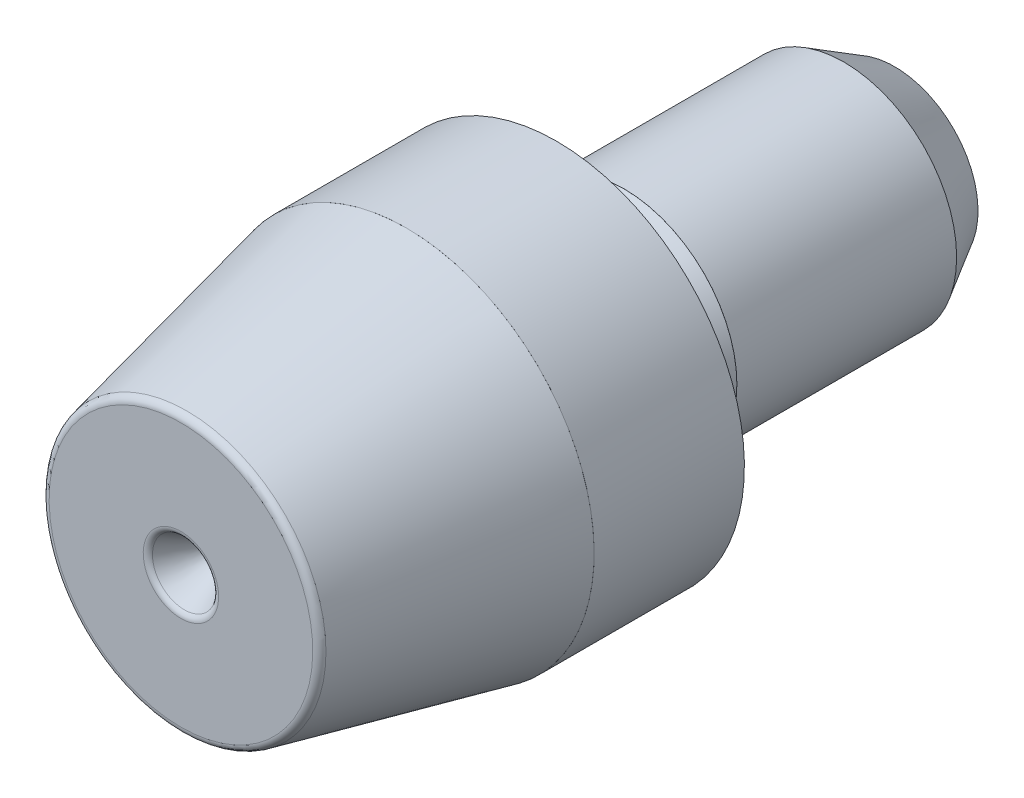
ISO-10303-21;
HEADER;
FILE_DESCRIPTION(('STEP AP214'),'2;1');
FILE_NAME('part.step','',(''),(''),'','','');
FILE_SCHEMA(('AUTOMOTIVE_DESIGN { 1 0 10303 214 1 1 1 1 }'));
ENDSEC;
DATA;
#1=APPLICATION_CONTEXT('core data for automotive mechanical design processes');
#2=APPLICATION_PROTOCOL_DEFINITION('international standard','automotive_design',2000,#1);
#3=PRODUCT_CONTEXT('',#1,'mechanical');
#4=PRODUCT('Part','Part','',(#3));
#5=PRODUCT_RELATED_PRODUCT_CATEGORY('part','',(#4));
#6=PRODUCT_DEFINITION_FORMATION('','',#4);
#7=PRODUCT_DEFINITION_CONTEXT('part definition',#1,'design');
#8=PRODUCT_DEFINITION('design','',#6,#7);
#9=PRODUCT_DEFINITION_SHAPE('','',#8);
#10=(LENGTH_UNIT() NAMED_UNIT(*) SI_UNIT(.MILLI.,.METRE.));
#11=(NAMED_UNIT(*) PLANE_ANGLE_UNIT() SI_UNIT($,.RADIAN.));
#12=(NAMED_UNIT(*) SI_UNIT($,.STERADIAN.) SOLID_ANGLE_UNIT());
#13=UNCERTAINTY_MEASURE_WITH_UNIT(LENGTH_MEASURE(1.E-05),#10,'distance_accuracy_value','');
#14=(GEOMETRIC_REPRESENTATION_CONTEXT(3) GLOBAL_UNCERTAINTY_ASSIGNED_CONTEXT((#13)) GLOBAL_UNIT_ASSIGNED_CONTEXT((#10,
#11,#12)) REPRESENTATION_CONTEXT('',''));
#15=CARTESIAN_POINT('',(0.,0.,0.));
#16=DIRECTION('',(0.,0.,1.));
#17=DIRECTION('',(1.,0.,0.));
#18=AXIS2_PLACEMENT_3D('',#15,#16,#17);
#19=CARTESIAN_POINT('',(0.,0.,-2.3));
#20=DIRECTION('',(0.,0.,-1.));
#21=DIRECTION('',(-1.,0.,0.));
#22=AXIS2_PLACEMENT_3D('',#19,#20,#21);
#23=CYLINDRICAL_SURFACE('',#22,3.001);
#24=CARTESIAN_POINT('',(0.,0.,-2.3));
#25=DIRECTION('',(0.,0.,-1.));
#26=DIRECTION('',(-1.,0.,0.));
#27=AXIS2_PLACEMENT_3D('',#24,#25,#26);
#28=CIRCLE('',#27,3.001);
#29=CARTESIAN_POINT('',(-3.001,0.,-2.3));
#30=VERTEX_POINT('',#29);
#31=EDGE_CURVE('E11',#30,#30,#28,.T.);
#32=ORIENTED_EDGE('',*,*,#31,.T.);
#33=EDGE_LOOP('',(#32));
#34=FACE_BOUND('',#33,.T.);
#35=CARTESIAN_POINT('',(0.,0.,-8.15));
#36=DIRECTION('',(0.,0.,-1.));
#37=DIRECTION('',(-1.,0.,0.));
#38=AXIS2_PLACEMENT_3D('',#35,#36,#37);
#39=CIRCLE('',#38,3.001);
#40=CARTESIAN_POINT('',(-3.001,0.,-8.15));
#41=VERTEX_POINT('',#40);
#42=EDGE_CURVE('E44',#41,#41,#39,.T.);
#43=ORIENTED_EDGE('',*,*,#42,.F.);
#44=EDGE_LOOP('',(#43));
#45=FACE_BOUND('',#44,.T.);
#46=ADVANCED_FACE('F41',(#34,#45),#23,.T.);
#47=CARTESIAN_POINT('',(0.,0.,-2.3));
#48=DIRECTION('',(0.,0.,-1.));
#49=DIRECTION('',(-1.,0.,0.));
#50=AXIS2_PLACEMENT_3D('',#47,#48,#49);
#51=PLANE('',#50);
#52=CARTESIAN_POINT('',(0.,0.,-2.3));
#53=DIRECTION('',(0.,0.,-1.));
#54=DIRECTION('',(-1.,0.,0.));
#55=AXIS2_PLACEMENT_3D('',#52,#53,#54);
#56=CIRCLE('',#55,3.);
#57=CARTESIAN_POINT('',(-3.,0.,-2.3));
#58=VERTEX_POINT('',#57);
#59=EDGE_CURVE('E51',#58,#58,#56,.T.);
#60=ORIENTED_EDGE('',*,*,#59,.T.);
#61=EDGE_LOOP('',(#60));
#62=FACE_BOUND('',#61,.T.);
#63=ORIENTED_EDGE('',*,*,#31,.F.);
#64=EDGE_LOOP('',(#63));
#65=FACE_BOUND('',#64,.T.);
#66=ADVANCED_FACE('F59',(#62,#65),#51,.F.);
#67=CARTESIAN_POINT('',(0.,0.,-8.15));
#68=DIRECTION('',(0.,0.,-1.));
#69=DIRECTION('',(-1.,0.,0.));
#70=AXIS2_PLACEMENT_3D('',#67,#68,#69);
#71=PLANE('',#70);
#72=CARTESIAN_POINT('',(0.,0.,-8.15));
#73=DIRECTION('',(0.,0.,-1.));
#74=DIRECTION('',(-1.,0.,0.));
#75=AXIS2_PLACEMENT_3D('',#72,#73,#74);
#76=CIRCLE('',#75,3.);
#77=CARTESIAN_POINT('',(-3.,0.,-8.15));
#78=VERTEX_POINT('',#77);
#79=EDGE_CURVE('E53',#78,#78,#76,.T.);
#80=ORIENTED_EDGE('',*,*,#79,.F.);
#81=EDGE_LOOP('',(#80));
#82=FACE_BOUND('',#81,.T.);
#83=ORIENTED_EDGE('',*,*,#42,.T.);
#84=EDGE_LOOP('',(#83));
#85=FACE_BOUND('',#84,.T.);
#86=ADVANCED_FACE('F65',(#82,#85),#71,.T.);
#87=CARTESIAN_POINT('',(0.,0.,-2.3));
#88=DIRECTION('',(0.,0.,-1.));
#89=DIRECTION('',(-1.,0.,0.));
#90=AXIS2_PLACEMENT_3D('',#87,#88,#89);
#91=CYLINDRICAL_SURFACE('',#90,3.);
#92=ORIENTED_EDGE('',*,*,#59,.F.);
#93=EDGE_LOOP('',(#92));
#94=FACE_BOUND('',#93,.T.);
#95=ORIENTED_EDGE('',*,*,#79,.T.);
#96=EDGE_LOOP('',(#95));
#97=FACE_BOUND('',#96,.T.);
#98=ADVANCED_FACE('F62',(#94,#97),#91,.F.);
#99=CLOSED_SHELL('',(#46,#66,#86,#98));
#100=MANIFOLD_SOLID_BREP('B2',#99);
#101=CARTESIAN_POINT('',(0.,0.,3.5));
#102=DIRECTION('',(0.,0.,-1.));
#103=DIRECTION('',(0.,1.,0.));
#104=AXIS2_PLACEMENT_3D('',#101,#102,#103);
#105=CYLINDRICAL_SURFACE('',#104,5.001);
#106=CARTESIAN_POINT('',(0.,0.,3.5));
#107=DIRECTION('',(0.,0.,-1.));
#108=DIRECTION('',(0.,1.,0.));
#109=AXIS2_PLACEMENT_3D('',#106,#107,#108);
#110=CIRCLE('',#109,5.001);
#111=CARTESIAN_POINT('',(0.,5.001,3.5));
#112=VERTEX_POINT('',#111);
#113=EDGE_CURVE('E40',#112,#112,#110,.T.);
#114=ORIENTED_EDGE('',*,*,#113,.T.);
#115=EDGE_LOOP('',(#114));
#116=FACE_BOUND('',#115,.T.);
#117=CARTESIAN_POINT('',(0.,0.,-0.500000000000001));
#118=DIRECTION('',(0.,0.,-1.));
#119=DIRECTION('',(0.,1.,0.));
#120=AXIS2_PLACEMENT_3D('',#117,#118,#119);
#121=CIRCLE('',#120,5.001);
#122=CARTESIAN_POINT('',(0.,5.001,-0.5));
#123=VERTEX_POINT('',#122);
#124=EDGE_CURVE('E112',#123,#123,#121,.T.);
#125=ORIENTED_EDGE('',*,*,#124,.F.);
#126=EDGE_LOOP('',(#125));
#127=FACE_BOUND('',#126,.T.);
#128=ADVANCED_FACE('F109',(#116,#127),#105,.T.);
#129=CARTESIAN_POINT('',(0.,0.,3.5));
#130=DIRECTION('',(0.,0.,-1.));
#131=DIRECTION('',(0.,1.,0.));
#132=AXIS2_PLACEMENT_3D('',#129,#130,#131);
#133=PLANE('',#132);
#134=CARTESIAN_POINT('',(0.,0.,3.5));
#135=DIRECTION('',(0.,0.,-1.));
#136=DIRECTION('',(0.,1.,0.));
#137=AXIS2_PLACEMENT_3D('',#134,#135,#136);
#138=CIRCLE('',#137,5.);
#139=CARTESIAN_POINT('',(0.,5.,3.5));
#140=VERTEX_POINT('',#139);
#141=EDGE_CURVE('E119',#140,#140,#138,.T.);
#142=ORIENTED_EDGE('',*,*,#141,.T.);
#143=EDGE_LOOP('',(#142));
#144=FACE_BOUND('',#143,.T.);
#145=ORIENTED_EDGE('',*,*,#113,.F.);
#146=EDGE_LOOP('',(#145));
#147=FACE_BOUND('',#146,.T.);
#148=ADVANCED_FACE('F127',(#144,#147),#133,.F.);
#149=CARTESIAN_POINT('',(0.,0.,-0.500000000000001));
#150=DIRECTION('',(0.,0.,-1.));
#151=DIRECTION('',(0.,1.,0.));
#152=AXIS2_PLACEMENT_3D('',#149,#150,#151);
#153=PLANE('',#152);
#154=CARTESIAN_POINT('',(0.,0.,-0.500000000000001));
#155=DIRECTION('',(0.,0.,-1.));
#156=DIRECTION('',(0.,1.,0.));
#157=AXIS2_PLACEMENT_3D('',#154,#155,#156);
#158=CIRCLE('',#157,5.);
#159=CARTESIAN_POINT('',(0.,5.,-0.5));
#160=VERTEX_POINT('',#159);
#161=EDGE_CURVE('E121',#160,#160,#158,.T.);
#162=ORIENTED_EDGE('',*,*,#161,.F.);
#163=EDGE_LOOP('',(#162));
#164=FACE_BOUND('',#163,.T.);
#165=ORIENTED_EDGE('',*,*,#124,.T.);
#166=EDGE_LOOP('',(#165));
#167=FACE_BOUND('',#166,.T.);
#168=ADVANCED_FACE('F133',(#164,#167),#153,.T.);
#169=CARTESIAN_POINT('',(0.,0.,3.5));
#170=DIRECTION('',(0.,0.,-1.));
#171=DIRECTION('',(0.,1.,0.));
#172=AXIS2_PLACEMENT_3D('',#169,#170,#171);
#173=CYLINDRICAL_SURFACE('',#172,5.);
#174=ORIENTED_EDGE('',*,*,#141,.F.);
#175=EDGE_LOOP('',(#174));
#176=FACE_BOUND('',#175,.T.);
#177=ORIENTED_EDGE('',*,*,#161,.T.);
#178=EDGE_LOOP('',(#177));
#179=FACE_BOUND('',#178,.T.);
#180=ADVANCED_FACE('F130',(#176,#179),#173,.F.);
#181=CLOSED_SHELL('',(#128,#148,#168,#180));
#182=MANIFOLD_SOLID_BREP('B6',#181);
#183=CARTESIAN_POINT('',(0.,0.,9.5));
#184=DIRECTION('',(0.,0.,1.));
#185=DIRECTION('',(0.,-1.,0.));
#186=AXIS2_PLACEMENT_3D('',#183,#184,#185);
#187=PLANE('',#186);
#188=CARTESIAN_POINT('',(0.,0.,9.5));
#189=DIRECTION('',(0.,0.,1.));
#190=DIRECTION('',(0.,-1.,0.));
#191=AXIS2_PLACEMENT_3D('',#188,#189,#190);
#192=CIRCLE('',#191,1.00392304845413);
#193=CARTESIAN_POINT('',(0.,-1.00392304845413,9.5));
#194=VERTEX_POINT('',#193);
#195=EDGE_CURVE('E108',#194,#194,#192,.F.);
#196=ORIENTED_EDGE('',*,*,#195,.T.);
#197=EDGE_LOOP('',(#196));
#198=FACE_BOUND('',#197,.T.);
#199=CARTESIAN_POINT('',(0.,0.,9.5));
#200=DIRECTION('',(0.,0.,1.));
#201=DIRECTION('',(0.,-1.,0.));
#202=AXIS2_PLACEMENT_3D('',#199,#200,#201);
#203=CIRCLE('',#202,3.50931505380808);
#204=CARTESIAN_POINT('',(0.,-3.50931505380808,9.5));
#205=VERTEX_POINT('',#204);
#206=EDGE_CURVE('E190',#205,#205,#203,.T.);
#207=ORIENTED_EDGE('',*,*,#206,.T.);
#208=EDGE_LOOP('',(#207));
#209=FACE_BOUND('',#208,.T.);
#210=ADVANCED_FACE('F170',(#198,#209),#187,.T.);
#211=CARTESIAN_POINT('',(0.,0.,3.5));
#212=DIRECTION('',(0.,0.,-1.));
#213=DIRECTION('',(0.,1.,0.));
#214=AXIS2_PLACEMENT_3D('',#211,#212,#213);
#215=CONICAL_SURFACE('',#214,5.,0.218166156499285);
#216=CARTESIAN_POINT('',(0.,0.,9.34328792278761));
#217=DIRECTION('',(0.,0.,1.));
#218=DIRECTION('',(0.,-1.,0.));
#219=AXIS2_PLACEMENT_3D('',#216,#217,#218);
#220=CIRCLE('',#219,3.70457425523207);
#221=CARTESIAN_POINT('',(0.,-3.70457425523207,9.34328792278761));
#222=VERTEX_POINT('',#221);
#223=EDGE_CURVE('E193',#222,#222,#220,.F.);
#224=ORIENTED_EDGE('',*,*,#223,.T.);
#225=EDGE_LOOP('',(#224));
#226=FACE_BOUND('',#225,.T.);
#227=CARTESIAN_POINT('',(0.,0.,3.5));
#228=DIRECTION('',(0.,0.,-1.));
#229=DIRECTION('',(0.,1.,0.));
#230=AXIS2_PLACEMENT_3D('',#227,#228,#229);
#231=CIRCLE('',#230,5.);
#232=CARTESIAN_POINT('',(0.,5.,3.5));
#233=VERTEX_POINT('',#232);
#234=EDGE_CURVE('E196',#233,#233,#231,.T.);
#235=ORIENTED_EDGE('',*,*,#234,.F.);
#236=EDGE_LOOP('',(#235));
#237=FACE_BOUND('',#236,.T.);
#238=ADVANCED_FACE('F250',(#226,#237),#215,.T.);
#239=CARTESIAN_POINT('',(0.,0.,-9.5));
#240=DIRECTION('',(0.,0.,-1.));
#241=DIRECTION('',(0.,1.,0.));
#242=AXIS2_PLACEMENT_3D('',#239,#240,#241);
#243=CYLINDRICAL_SURFACE('',#242,5.);
#244=ORIENTED_EDGE('',*,*,#234,.T.);
#245=EDGE_LOOP('',(#244));
#246=FACE_BOUND('',#245,.T.);
#247=CARTESIAN_POINT('',(0.,0.,-0.500000000000002));
#248=DIRECTION('',(0.,0.,-1.));
#249=DIRECTION('',(0.,1.,0.));
#250=AXIS2_PLACEMENT_3D('',#247,#248,#249);
#251=CIRCLE('',#250,5.);
#252=CARTESIAN_POINT('',(0.,5.,-0.500000000000001));
#253=VERTEX_POINT('',#252);
#254=EDGE_CURVE('E199',#253,#253,#251,.T.);
#255=ORIENTED_EDGE('',*,*,#254,.F.);
#256=EDGE_LOOP('',(#255));
#257=FACE_BOUND('',#256,.T.);
#258=ADVANCED_FACE('F255',(#246,#257),#243,.T.);
#259=CARTESIAN_POINT('',(0.,5.,-0.5));
#260=DIRECTION('',(0.,0.,-1.));
#261=DIRECTION('',(0.,1.,0.));
#262=AXIS2_PLACEMENT_3D('',#259,#260,#261);
#263=PLANE('',#262);
#264=ORIENTED_EDGE('',*,*,#254,.T.);
#265=EDGE_LOOP('',(#264));
#266=FACE_BOUND('',#265,.T.);
#267=CARTESIAN_POINT('',(0.,0.,-0.5));
#268=DIRECTION('',(0.,0.,1.));
#269=DIRECTION('',(0.,-1.,0.));
#270=AXIS2_PLACEMENT_3D('',#267,#268,#269);
#271=CIRCLE('',#270,3.);
#272=CARTESIAN_POINT('',(0.,-3.,-0.500000000000001));
#273=VERTEX_POINT('',#272);
#274=EDGE_CURVE('E222',#273,#273,#271,.T.);
#275=ORIENTED_EDGE('',*,*,#274,.T.);
#276=EDGE_LOOP('',(#275));
#277=FACE_BOUND('',#276,.T.);
#278=ADVANCED_FACE('F314',(#266,#277),#263,.T.);
#279=CARTESIAN_POINT('',(0.,0.,-0.500000000000003));
#280=DIRECTION('',(0.,0.,1.));
#281=DIRECTION('',(0.,-1.,0.));
#282=AXIS2_PLACEMENT_3D('',#279,#280,#281);
#283=TOROIDAL_SURFACE('',#282,2.75,0.125);
#284=CARTESIAN_POINT('',(0.,0.,-0.500000000000002));
#285=DIRECTION('',(0.,0.,1.));
#286=DIRECTION('',(0.,-1.,0.));
#287=AXIS2_PLACEMENT_3D('',#284,#285,#286);
#288=CIRCLE('',#287,2.625);
#289=CARTESIAN_POINT('',(0.,-2.625,-0.500000000000003));
#290=VERTEX_POINT('',#289);
#291=EDGE_CURVE('E202',#290,#290,#288,.T.);
#292=ORIENTED_EDGE('',*,*,#291,.T.);
#293=EDGE_LOOP('',(#292));
#294=FACE_BOUND('',#293,.T.);
#295=CARTESIAN_POINT('',(0.,0.,-0.391746824526949));
#296=DIRECTION('',(0.,0.,1.));
#297=DIRECTION('',(0.,-1.,0.));
#298=AXIS2_PLACEMENT_3D('',#295,#296,#297);
#299=CIRCLE('',#298,2.8125);
#300=CARTESIAN_POINT('',(0.,-2.8125,-0.391746824526949));
#301=VERTEX_POINT('',#300);
#302=EDGE_CURVE('E206',#301,#301,#299,.T.);
#303=ORIENTED_EDGE('',*,*,#302,.F.);
#304=EDGE_LOOP('',(#303));
#305=FACE_BOUND('',#304,.T.);
#306=ADVANCED_FACE('F308',(#294,#305),#283,.F.);
#307=CARTESIAN_POINT('',(0.,0.,9.5));
#308=DIRECTION('',(0.,0.,1.));
#309=DIRECTION('',(0.,-1.,0.));
#310=AXIS2_PLACEMENT_3D('',#307,#308,#309);
#311=CYLINDRICAL_SURFACE('',#310,2.625);
#312=CARTESIAN_POINT('',(0.,0.,-1.13745073217315));
#313=DIRECTION('',(0.,0.,1.));
#314=DIRECTION('',(0.,-1.,0.));
#315=AXIS2_PLACEMENT_3D('',#312,#313,#314);
#316=CIRCLE('',#315,2.625);
#317=CARTESIAN_POINT('',(0.,-2.625,-1.13745073217315));
#318=VERTEX_POINT('',#317);
#319=EDGE_CURVE('E213',#318,#318,#316,.T.);
#320=ORIENTED_EDGE('',*,*,#319,.T.);
#321=EDGE_LOOP('',(#320));
#322=FACE_BOUND('',#321,.T.);
#323=ORIENTED_EDGE('',*,*,#291,.F.);
#324=EDGE_LOOP('',(#323));
#325=FACE_BOUND('',#324,.T.);
#326=ADVANCED_FACE('F302',(#322,#325),#311,.T.);
#327=CARTESIAN_POINT('',(0.,0.,-1.13745073217315));
#328=DIRECTION('',(0.,0.,1.));
#329=DIRECTION('',(0.,-1.,0.));
#330=AXIS2_PLACEMENT_3D('',#327,#328,#329);
#331=TOROIDAL_SURFACE('',#330,3.375,0.75);
#332=CARTESIAN_POINT('',(0.,0.,-1.3939658396674));
#333=DIRECTION('',(0.,0.,1.));
#334=DIRECTION('',(0.,-1.,0.));
#335=AXIS2_PLACEMENT_3D('',#332,#333,#334);
#336=CIRCLE('',#335,2.67023053441057);
#337=CARTESIAN_POINT('',(0.,-2.67023053441056,-1.3939658396674));
#338=VERTEX_POINT('',#337);
#339=EDGE_CURVE('E216',#338,#338,#336,.T.);
#340=ORIENTED_EDGE('',*,*,#339,.T.);
#341=EDGE_LOOP('',(#340));
#342=FACE_BOUND('',#341,.T.);
#343=ORIENTED_EDGE('',*,*,#319,.F.);
#344=EDGE_LOOP('',(#343));
#345=FACE_BOUND('',#344,.T.);
#346=ADVANCED_FACE('F296',(#342,#345),#331,.F.);
#347=CARTESIAN_POINT('',(0.,0.,-1.3939658396674));
#348=DIRECTION('',(0.,0.,-1.));
#349=DIRECTION('',(0.,1.,0.));
#350=AXIS2_PLACEMENT_3D('',#347,#348,#349);
#351=CONICAL_SURFACE('',#350,2.67023053441057,0.349065850398859);
#352=CARTESIAN_POINT('',(0.,0.,-2.3));
#353=DIRECTION('',(0.,0.,1.));
#354=DIRECTION('',(0.,-1.,0.));
#355=AXIS2_PLACEMENT_3D('',#352,#353,#354);
#356=CIRCLE('',#355,3.);
#357=CARTESIAN_POINT('',(0.,-3.,-2.3));
#358=VERTEX_POINT('',#357);
#359=EDGE_CURVE('E219',#358,#358,#356,.T.);
#360=ORIENTED_EDGE('',*,*,#359,.T.);
#361=EDGE_LOOP('',(#360));
#362=FACE_BOUND('',#361,.T.);
#363=ORIENTED_EDGE('',*,*,#339,.F.);
#364=EDGE_LOOP('',(#363));
#365=FACE_BOUND('',#364,.T.);
#366=ADVANCED_FACE('F293',(#362,#365),#351,.T.);
#367=CARTESIAN_POINT('',(0.,0.,-0.5));
#368=DIRECTION('',(0.,0.,-1.));
#369=DIRECTION('',(0.,1.,0.));
#370=AXIS2_PLACEMENT_3D('',#367,#368,#369);
#371=CONICAL_SURFACE('',#370,3.,1.04719755119661);
#372=ORIENTED_EDGE('',*,*,#302,.T.);
#373=EDGE_LOOP('',(#372));
#374=FACE_BOUND('',#373,.T.);
#375=ORIENTED_EDGE('',*,*,#274,.F.);
#376=EDGE_LOOP('',(#375));
#377=FACE_BOUND('',#376,.T.);
#378=ADVANCED_FACE('F289',(#374,#377),#371,.F.);
#379=CARTESIAN_POINT('',(0.,0.,-9.5));
#380=DIRECTION('',(0.,0.,-1.));
#381=DIRECTION('',(0.,1.,0.));
#382=AXIS2_PLACEMENT_3D('',#379,#380,#381);
#383=CYLINDRICAL_SURFACE('',#382,3.);
#384=CARTESIAN_POINT('',(0.,0.,-8.15));
#385=DIRECTION('',(0.,0.,1.));
#386=DIRECTION('',(0.,-1.,0.));
#387=AXIS2_PLACEMENT_3D('',#384,#385,#386);
#388=CIRCLE('',#387,3.);
#389=CARTESIAN_POINT('',(0.,-2.99999999999999,-8.15));
#390=VERTEX_POINT('',#389);
#391=EDGE_CURVE('E207',#390,#390,#388,.T.);
#392=ORIENTED_EDGE('',*,*,#391,.T.);
#393=EDGE_LOOP('',(#392));
#394=FACE_BOUND('',#393,.T.);
#395=ORIENTED_EDGE('',*,*,#359,.F.);
#396=EDGE_LOOP('',(#395));
#397=FACE_BOUND('',#396,.T.);
#398=ADVANCED_FACE('F283',(#394,#397),#383,.T.);
#399=CARTESIAN_POINT('',(0.,0.,-8.15));
#400=DIRECTION('',(0.,0.,1.));
#401=DIRECTION('',(0.,-1.,0.));
#402=AXIS2_PLACEMENT_3D('',#399,#400,#401);
#403=CONICAL_SURFACE('',#402,3.,0.523598775598292);
#404=CARTESIAN_POINT('',(0.,0.,-9.5));
#405=DIRECTION('',(0.,0.,1.));
#406=DIRECTION('',(0.,-1.,0.));
#407=AXIS2_PLACEMENT_3D('',#404,#405,#406);
#408=CIRCLE('',#407,2.22057713659401);
#409=CARTESIAN_POINT('',(0.,-2.22057713659401,-9.5));
#410=VERTEX_POINT('',#409);
#411=EDGE_CURVE('E203',#410,#410,#408,.T.);
#412=ORIENTED_EDGE('',*,*,#411,.T.);
#413=EDGE_LOOP('',(#412));
#414=FACE_BOUND('',#413,.T.);
#415=ORIENTED_EDGE('',*,*,#391,.F.);
#416=EDGE_LOOP('',(#415));
#417=FACE_BOUND('',#416,.T.);
#418=ADVANCED_FACE('F277',(#414,#417),#403,.T.);
#419=CARTESIAN_POINT('',(0.,3.,-9.5));
#420=DIRECTION('',(0.,0.,-1.));
#421=DIRECTION('',(0.,1.,0.));
#422=AXIS2_PLACEMENT_3D('',#419,#420,#421);
#423=PLANE('',#422);
#424=CARTESIAN_POINT('',(0.,0.,-9.5));
#425=DIRECTION('',(0.,0.,-1.));
#426=DIRECTION('',(0.,1.,0.));
#427=AXIS2_PLACEMENT_3D('',#424,#425,#426);
#428=CIRCLE('',#427,1.00392304845413);
#429=CARTESIAN_POINT('',(0.,1.00392304845413,-9.5));
#430=VERTEX_POINT('',#429);
#431=EDGE_CURVE('E181',#430,#430,#428,.F.);
#432=ORIENTED_EDGE('',*,*,#431,.T.);
#433=EDGE_LOOP('',(#432));
#434=FACE_BOUND('',#433,.T.);
#435=ORIENTED_EDGE('',*,*,#411,.F.);
#436=EDGE_LOOP('',(#435));
#437=FACE_BOUND('',#436,.T.);
#438=ADVANCED_FACE('F274',(#434,#437),#423,.T.);
#439=CARTESIAN_POINT('',(0.,0.,9.5));
#440=DIRECTION('',(0.,0.,1.));
#441=DIRECTION('',(1.,0.,0.));
#442=AXIS2_PLACEMENT_3D('',#439,#440,#441);
#443=CONICAL_SURFACE('',#442,0.9,0.5235987755983);
#444=CARTESIAN_POINT('',(0.,0.,9.41));
#445=DIRECTION('',(0.,0.,1.));
#446=DIRECTION('',(1.,0.,0.));
#447=AXIS2_PLACEMENT_3D('',#444,#445,#446);
#448=CIRCLE('',#447,0.848038475772933);
#449=CARTESIAN_POINT('',(0.848038475772933,0.,9.41));
#450=VERTEX_POINT('',#449);
#451=EDGE_CURVE('E177',#450,#450,#448,.T.);
#452=ORIENTED_EDGE('',*,*,#451,.T.);
#453=EDGE_LOOP('',(#452));
#454=FACE_BOUND('',#453,.T.);
#455=CARTESIAN_POINT('',(0.,0.,8.));
#456=DIRECTION('',(0.,0.,1.));
#457=DIRECTION('',(1.,0.,0.));
#458=AXIS2_PLACEMENT_3D('',#455,#456,#457);
#459=CIRCLE('',#458,0.0339745962155591);
#460=CARTESIAN_POINT('',(0.0339745962155591,0.,8.));
#461=VERTEX_POINT('',#460);
#462=EDGE_CURVE('E210',#461,#461,#459,.T.);
#463=ORIENTED_EDGE('',*,*,#462,.F.);
#464=EDGE_LOOP('',(#463));
#465=FACE_BOUND('',#464,.T.);
#466=ADVANCED_FACE('F246',(#454,#465),#443,.F.);
#467=CARTESIAN_POINT('',(0.,0.,8.));
#468=DIRECTION('',(0.,0.,1.));
#469=DIRECTION('',(1.,0.,0.));
#470=AXIS2_PLACEMENT_3D('',#467,#468,#469);
#471=PLANE('',#470);
#472=ORIENTED_EDGE('',*,*,#462,.T.);
#473=EDGE_LOOP('',(#472));
#474=FACE_BOUND('',#473,.T.);
#475=ADVANCED_FACE('F237',(#474),#471,.T.);
#476=CARTESIAN_POINT('',(0.,0.,-9.5));
#477=DIRECTION('',(0.,0.,-1.));
#478=DIRECTION('',(0.,1.,0.));
#479=AXIS2_PLACEMENT_3D('',#476,#477,#478);
#480=CONICAL_SURFACE('',#479,0.9,0.5235987755983);
#481=CARTESIAN_POINT('',(0.,0.,-9.41));
#482=DIRECTION('',(0.,0.,-1.));
#483=DIRECTION('',(0.,1.,0.));
#484=AXIS2_PLACEMENT_3D('',#481,#482,#483);
#485=CIRCLE('',#484,0.848038475772933);
#486=CARTESIAN_POINT('',(0.,0.848038475772935,-9.41));
#487=VERTEX_POINT('',#486);
#488=EDGE_CURVE('E185',#487,#487,#485,.T.);
#489=ORIENTED_EDGE('',*,*,#488,.T.);
#490=EDGE_LOOP('',(#489));
#491=FACE_BOUND('',#490,.T.);
#492=CARTESIAN_POINT('',(0.,0.,-8.));
#493=DIRECTION('',(0.,0.,-1.));
#494=DIRECTION('',(0.,1.,0.));
#495=AXIS2_PLACEMENT_3D('',#492,#493,#494);
#496=CIRCLE('',#495,0.0339745962155591);
#497=CARTESIAN_POINT('',(0.,0.0339745962155606,-8.));
#498=VERTEX_POINT('',#497);
#499=EDGE_CURVE('E229',#498,#498,#496,.T.);
#500=ORIENTED_EDGE('',*,*,#499,.F.);
#501=EDGE_LOOP('',(#500));
#502=FACE_BOUND('',#501,.T.);
#503=ADVANCED_FACE('F235',(#491,#502),#480,.F.);
#504=CARTESIAN_POINT('',(0.,0.,-8.));
#505=DIRECTION('',(0.,0.,-1.));
#506=DIRECTION('',(0.,1.,0.));
#507=AXIS2_PLACEMENT_3D('',#504,#505,#506);
#508=PLANE('',#507);
#509=ORIENTED_EDGE('',*,*,#499,.T.);
#510=EDGE_LOOP('',(#509));
#511=FACE_BOUND('',#510,.T.);
#512=ADVANCED_FACE('F233',(#511),#508,.T.);
#513=CARTESIAN_POINT('',(0.,0.,9.3));
#514=DIRECTION('',(0.,0.,1.));
#515=DIRECTION('',(0.,-1.,0.));
#516=AXIS2_PLACEMENT_3D('',#513,#514,#515);
#517=TOROIDAL_SURFACE('',#516,3.50931505380808,0.2);
#518=ORIENTED_EDGE('',*,*,#206,.F.);
#519=EDGE_LOOP('',(#518));
#520=FACE_BOUND('',#519,.T.);
#521=ORIENTED_EDGE('',*,*,#223,.F.);
#522=EDGE_LOOP('',(#521));
#523=FACE_BOUND('',#522,.T.);
#524=ADVANCED_FACE('F244',(#520,#523),#517,.T.);
#525=CARTESIAN_POINT('',(0.,0.,-9.32));
#526=DIRECTION('',(0.,0.,-1.));
#527=DIRECTION('',(0.,1.,0.));
#528=AXIS2_PLACEMENT_3D('',#525,#526,#527);
#529=TOROIDAL_SURFACE('',#528,1.00392304845413,0.18);
#530=ORIENTED_EDGE('',*,*,#431,.F.);
#531=EDGE_LOOP('',(#530));
#532=FACE_BOUND('',#531,.T.);
#533=ORIENTED_EDGE('',*,*,#488,.F.);
#534=EDGE_LOOP('',(#533));
#535=FACE_BOUND('',#534,.T.);
#536=ADVANCED_FACE('F262',(#532,#535),#529,.T.);
#537=CARTESIAN_POINT('',(0.,0.,9.32));
#538=DIRECTION('',(0.,0.,1.));
#539=DIRECTION('',(0.,-1.,0.));
#540=AXIS2_PLACEMENT_3D('',#537,#538,#539);
#541=TOROIDAL_SURFACE('',#540,1.00392304845413,0.18);
#542=ORIENTED_EDGE('',*,*,#195,.F.);
#543=EDGE_LOOP('',(#542));
#544=FACE_BOUND('',#543,.T.);
#545=ORIENTED_EDGE('',*,*,#451,.F.);
#546=EDGE_LOOP('',(#545));
#547=FACE_BOUND('',#546,.T.);
#548=ADVANCED_FACE('F172',(#544,#547),#541,.T.);
#549=CLOSED_SHELL('',(#210,#238,#258,#278,#306,#326,#346,#366,#378,#398,#418,#438,#466,#475,
#503,#512,#524,#536,#548));
#550=MANIFOLD_SOLID_BREP('B35',#549);
#551=ADVANCED_BREP_SHAPE_REPRESENTATION('',(#18,#100,#182,#550),#14);
#552=SHAPE_DEFINITION_REPRESENTATION(#9,#551);
ENDSEC;
END-ISO-10303-21;
